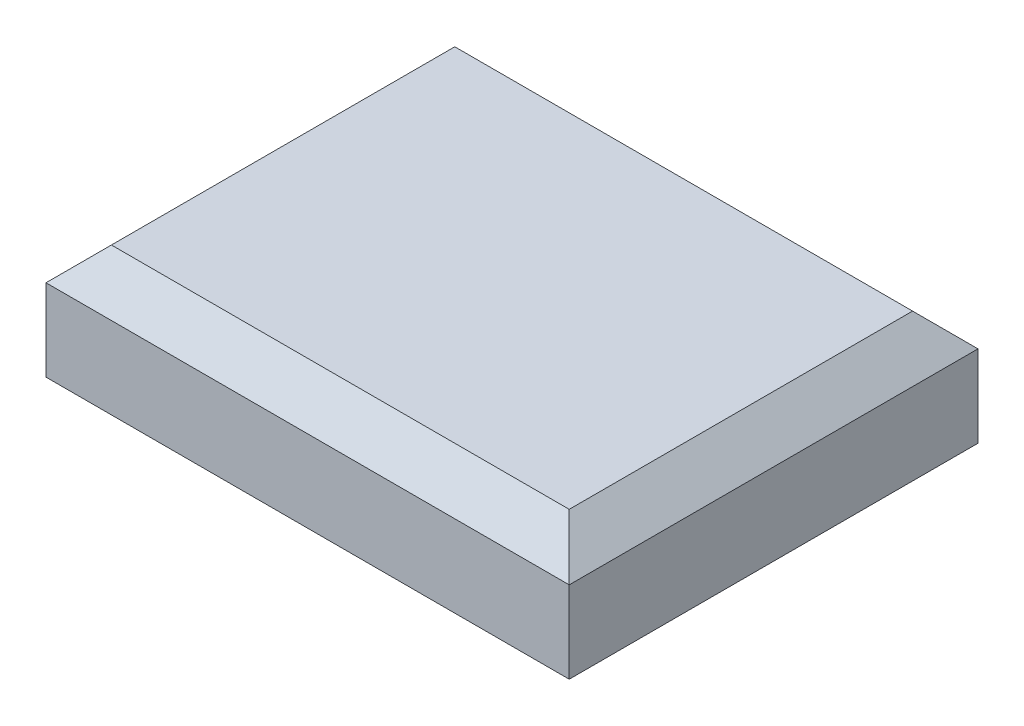
ISO-10303-21;
HEADER;
FILE_DESCRIPTION(('STEP AP214'),'2;1');
FILE_NAME('part.step','',(''),(''),'','','');
FILE_SCHEMA(('AUTOMOTIVE_DESIGN { 1 0 10303 214 1 1 1 1 }'));
ENDSEC;
DATA;
#1=APPLICATION_CONTEXT('core data for automotive mechanical design processes');
#2=APPLICATION_PROTOCOL_DEFINITION('international standard','automotive_design',2000,#1);
#3=PRODUCT_CONTEXT('',#1,'mechanical');
#4=PRODUCT('Part','Part','',(#3));
#5=PRODUCT_RELATED_PRODUCT_CATEGORY('part','',(#4));
#6=PRODUCT_DEFINITION_FORMATION('','',#4);
#7=PRODUCT_DEFINITION_CONTEXT('part definition',#1,'design');
#8=PRODUCT_DEFINITION('design','',#6,#7);
#9=PRODUCT_DEFINITION_SHAPE('','',#8);
#10=(LENGTH_UNIT() NAMED_UNIT(*) SI_UNIT(.MILLI.,.METRE.));
#11=(NAMED_UNIT(*) PLANE_ANGLE_UNIT() SI_UNIT($,.RADIAN.));
#12=(NAMED_UNIT(*) SI_UNIT($,.STERADIAN.) SOLID_ANGLE_UNIT());
#13=UNCERTAINTY_MEASURE_WITH_UNIT(LENGTH_MEASURE(1.E-05),#10,'distance_accuracy_value','');
#14=(GEOMETRIC_REPRESENTATION_CONTEXT(3) GLOBAL_UNCERTAINTY_ASSIGNED_CONTEXT((#13)) GLOBAL_UNIT_ASSIGNED_CONTEXT((#10,
#11,#12)) REPRESENTATION_CONTEXT('',''));
#15=CARTESIAN_POINT('',(0.,0.,0.));
#16=DIRECTION('',(0.,0.,1.));
#17=DIRECTION('',(1.,0.,0.));
#18=AXIS2_PLACEMENT_3D('',#15,#16,#17);
#19=CARTESIAN_POINT('',(1.6,0.7,1.25));
#20=DIRECTION('',(-1.,0.,0.));
#21=DIRECTION('',(0.,0.,1.));
#22=AXIS2_PLACEMENT_3D('',#19,#20,#21);
#23=PLANE('',#22);
#24=DIRECTION('',(0.,-1.,0.));
#25=VECTOR('',#24,1.);
#26=CARTESIAN_POINT('',(1.6,0.7,-1.25));
#27=LINE('',#26,#25);
#28=CARTESIAN_POINT('',(1.6,0.5,-1.25));
#29=VERTEX_POINT('',#28);
#30=CARTESIAN_POINT('',(1.6,0.,-1.25));
#31=VERTEX_POINT('',#30);
#32=EDGE_CURVE('E68',#29,#31,#27,.T.);
#33=ORIENTED_EDGE('',*,*,#32,.F.);
#34=DIRECTION('',(0.,0.,1.));
#35=VECTOR('',#34,1.);
#36=CARTESIAN_POINT('',(1.6,0.5,1.25));
#37=LINE('',#36,#35);
#38=CARTESIAN_POINT('',(1.6,0.5,1.25));
#39=VERTEX_POINT('',#38);
#40=EDGE_CURVE('E11',#29,#39,#37,.T.);
#41=ORIENTED_EDGE('',*,*,#40,.T.);
#42=DIRECTION('',(0.,-1.,0.));
#43=VECTOR('',#42,1.);
#44=CARTESIAN_POINT('',(1.6,0.7,1.25));
#45=LINE('',#44,#43);
#46=CARTESIAN_POINT('',(1.6,0.,1.25));
#47=VERTEX_POINT('',#46);
#48=EDGE_CURVE('E88',#39,#47,#45,.T.);
#49=ORIENTED_EDGE('',*,*,#48,.T.);
#50=DIRECTION('',(0.,0.,-1.));
#51=VECTOR('',#50,1.);
#52=CARTESIAN_POINT('',(1.6,0.,1.25));
#53=LINE('',#52,#51);
#54=EDGE_CURVE('E83',#47,#31,#53,.T.);
#55=ORIENTED_EDGE('',*,*,#54,.T.);
#56=EDGE_LOOP('',(#33,#41,#49,#55));
#57=FACE_BOUND('',#56,.T.);
#58=ADVANCED_FACE('F16',(#57),#23,.F.);
#59=CARTESIAN_POINT('',(-1.6,0.7,-1.25));
#60=DIRECTION('',(0.,0.,1.));
#61=DIRECTION('',(1.,0.,0.));
#62=AXIS2_PLACEMENT_3D('',#59,#60,#61);
#63=PLANE('',#62);
#64=DIRECTION('',(0.,-1.,0.));
#65=VECTOR('',#64,1.);
#66=CARTESIAN_POINT('',(-1.6,0.7,-1.25));
#67=LINE('',#66,#65);
#68=CARTESIAN_POINT('',(-1.6,0.5,-1.25));
#69=VERTEX_POINT('',#68);
#70=CARTESIAN_POINT('',(-1.6,0.,-1.25));
#71=VERTEX_POINT('',#70);
#72=EDGE_CURVE('E77',#69,#71,#67,.T.);
#73=ORIENTED_EDGE('',*,*,#72,.F.);
#74=DIRECTION('',(1.,0.,0.));
#75=VECTOR('',#74,1.);
#76=CARTESIAN_POINT('',(-1.6,0.5,-1.25));
#77=LINE('',#76,#75);
#78=EDGE_CURVE('E25',#69,#29,#77,.T.);
#79=ORIENTED_EDGE('',*,*,#78,.T.);
#80=ORIENTED_EDGE('',*,*,#32,.T.);
#81=DIRECTION('',(-1.,0.,0.));
#82=VECTOR('',#81,1.);
#83=CARTESIAN_POINT('',(-1.6,0.,-1.25));
#84=LINE('',#83,#82);
#85=EDGE_CURVE('E71',#31,#71,#84,.T.);
#86=ORIENTED_EDGE('',*,*,#85,.T.);
#87=EDGE_LOOP('',(#73,#79,#80,#86));
#88=FACE_BOUND('',#87,.T.);
#89=ADVANCED_FACE('F70',(#88),#63,.F.);
#90=CARTESIAN_POINT('',(-1.6,0.7,1.25));
#91=DIRECTION('',(1.,0.,0.));
#92=DIRECTION('',(0.,0.,-1.));
#93=AXIS2_PLACEMENT_3D('',#90,#91,#92);
#94=PLANE('',#93);
#95=DIRECTION('',(0.,-1.,0.));
#96=VECTOR('',#95,1.);
#97=CARTESIAN_POINT('',(-1.6,0.7,1.25));
#98=LINE('',#97,#96);
#99=CARTESIAN_POINT('',(-1.6,0.5,1.25));
#100=VERTEX_POINT('',#99);
#101=CARTESIAN_POINT('',(-1.6,0.,1.25));
#102=VERTEX_POINT('',#101);
#103=EDGE_CURVE('E98',#100,#102,#98,.T.);
#104=ORIENTED_EDGE('',*,*,#103,.F.);
#105=DIRECTION('',(0.,0.,-1.));
#106=VECTOR('',#105,1.);
#107=CARTESIAN_POINT('',(-1.6,0.5,1.25));
#108=LINE('',#107,#106);
#109=EDGE_CURVE('E40',#100,#69,#108,.T.);
#110=ORIENTED_EDGE('',*,*,#109,.T.);
#111=ORIENTED_EDGE('',*,*,#72,.T.);
#112=DIRECTION('',(0.,0.,1.));
#113=VECTOR('',#112,1.);
#114=CARTESIAN_POINT('',(-1.6,0.,1.25));
#115=LINE('',#114,#113);
#116=EDGE_CURVE('E85',#71,#102,#115,.T.);
#117=ORIENTED_EDGE('',*,*,#116,.T.);
#118=EDGE_LOOP('',(#104,#110,#111,#117));
#119=FACE_BOUND('',#118,.T.);
#120=ADVANCED_FACE('F136',(#119),#94,.F.);
#121=CARTESIAN_POINT('',(-1.6,0.7,1.25));
#122=DIRECTION('',(0.,0.,-1.));
#123=DIRECTION('',(-1.,0.,0.));
#124=AXIS2_PLACEMENT_3D('',#121,#122,#123);
#125=PLANE('',#124);
#126=ORIENTED_EDGE('',*,*,#48,.F.);
#127=DIRECTION('',(-1.,0.,0.));
#128=VECTOR('',#127,1.);
#129=CARTESIAN_POINT('',(-1.6,0.5,1.25));
#130=LINE('',#129,#128);
#131=EDGE_CURVE('E109',#39,#100,#130,.T.);
#132=ORIENTED_EDGE('',*,*,#131,.T.);
#133=ORIENTED_EDGE('',*,*,#103,.T.);
#134=DIRECTION('',(1.,0.,0.));
#135=VECTOR('',#134,1.);
#136=CARTESIAN_POINT('',(-1.6,0.,1.25));
#137=LINE('',#136,#135);
#138=EDGE_CURVE('E95',#102,#47,#137,.T.);
#139=ORIENTED_EDGE('',*,*,#138,.T.);
#140=EDGE_LOOP('',(#126,#132,#133,#139));
#141=FACE_BOUND('',#140,.T.);
#142=ADVANCED_FACE('F135',(#141),#125,.F.);
#143=CARTESIAN_POINT('',(0.,0.7,0.));
#144=DIRECTION('',(0.,-1.,0.));
#145=DIRECTION('',(0.,0.,-1.));
#146=AXIS2_PLACEMENT_3D('',#143,#144,#145);
#147=PLANE('',#146);
#148=DIRECTION('',(0.,0.,1.));
#149=VECTOR('',#148,1.);
#150=CARTESIAN_POINT('',(-1.4,0.7,0.));
#151=LINE('',#150,#149);
#152=CARTESIAN_POINT('',(-1.4,0.7,-1.05));
#153=VERTEX_POINT('',#152);
#154=CARTESIAN_POINT('',(-1.4,0.7,1.05));
#155=VERTEX_POINT('',#154);
#156=EDGE_CURVE('E104',#153,#155,#151,.T.);
#157=ORIENTED_EDGE('',*,*,#156,.T.);
#158=DIRECTION('',(1.,0.,0.));
#159=VECTOR('',#158,1.);
#160=CARTESIAN_POINT('',(0.,0.7,1.05));
#161=LINE('',#160,#159);
#162=CARTESIAN_POINT('',(1.4,0.7,1.05));
#163=VERTEX_POINT('',#162);
#164=EDGE_CURVE('E106',#155,#163,#161,.T.);
#165=ORIENTED_EDGE('',*,*,#164,.T.);
#166=DIRECTION('',(0.,0.,-1.));
#167=VECTOR('',#166,1.);
#168=CARTESIAN_POINT('',(1.4,0.7,0.));
#169=LINE('',#168,#167);
#170=CARTESIAN_POINT('',(1.4,0.7,-1.05));
#171=VERTEX_POINT('',#170);
#172=EDGE_CURVE('E76',#163,#171,#169,.T.);
#173=ORIENTED_EDGE('',*,*,#172,.T.);
#174=DIRECTION('',(-1.,0.,0.));
#175=VECTOR('',#174,1.);
#176=CARTESIAN_POINT('',(0.,0.7,-1.05));
#177=LINE('',#176,#175);
#178=EDGE_CURVE('E102',#171,#153,#177,.T.);
#179=ORIENTED_EDGE('',*,*,#178,.T.);
#180=EDGE_LOOP('',(#157,#165,#173,#179));
#181=FACE_BOUND('',#180,.T.);
#182=ADVANCED_FACE('F128',(#181),#147,.F.);
#183=CARTESIAN_POINT('',(0.,0.,0.));
#184=DIRECTION('',(0.,-1.,0.));
#185=DIRECTION('',(0.,0.,-1.));
#186=AXIS2_PLACEMENT_3D('',#183,#184,#185);
#187=PLANE('',#186);
#188=ORIENTED_EDGE('',*,*,#54,.F.);
#189=ORIENTED_EDGE('',*,*,#138,.F.);
#190=ORIENTED_EDGE('',*,*,#116,.F.);
#191=ORIENTED_EDGE('',*,*,#85,.F.);
#192=EDGE_LOOP('',(#188,#189,#190,#191));
#193=FACE_BOUND('',#192,.T.);
#194=ADVANCED_FACE('F81',(#193),#187,.T.);
#195=CARTESIAN_POINT('',(0.,0.7,-1.05));
#196=DIRECTION('',(0.,-0.707106781186546,0.707106781186549));
#197=DIRECTION('',(-1.,0.,0.));
#198=AXIS2_PLACEMENT_3D('',#195,#196,#197);
#199=PLANE('',#198);
#200=DIRECTION('',(-0.577350269189625,0.577350269189628,0.577350269189625));
#201=VECTOR('',#200,1.);
#202=CARTESIAN_POINT('',(1.05,1.05,-0.7));
#203=LINE('',#202,#201);
#204=EDGE_CURVE('E92',#29,#171,#203,.T.);
#205=ORIENTED_EDGE('',*,*,#204,.F.);
#206=ORIENTED_EDGE('',*,*,#78,.F.);
#207=DIRECTION('',(0.577350269189625,0.577350269189628,0.577350269189625));
#208=VECTOR('',#207,1.);
#209=CARTESIAN_POINT('',(-0.933333333333335,1.16666666666667,-0.583333333333335));
#210=LINE('',#209,#208);
#211=EDGE_CURVE('E20',#153,#69,#210,.F.);
#212=ORIENTED_EDGE('',*,*,#211,.F.);
#213=ORIENTED_EDGE('',*,*,#178,.F.);
#214=EDGE_LOOP('',(#205,#206,#212,#213));
#215=FACE_BOUND('',#214,.T.);
#216=ADVANCED_FACE('F18',(#215),#199,.F.);
#217=CARTESIAN_POINT('',(-1.4,0.7,0.));
#218=DIRECTION('',(0.707106781186549,-0.707106781186546,0.));
#219=DIRECTION('',(0.,0.,1.));
#220=AXIS2_PLACEMENT_3D('',#217,#218,#219);
#221=PLANE('',#220);
#222=ORIENTED_EDGE('',*,*,#211,.T.);
#223=ORIENTED_EDGE('',*,*,#109,.F.);
#224=DIRECTION('',(0.577350269189625,0.577350269189628,-0.577350269189625));
#225=VECTOR('',#224,1.);
#226=CARTESIAN_POINT('',(-1.05,1.05,0.7));
#227=LINE('',#226,#225);
#228=EDGE_CURVE('E116',#155,#100,#227,.F.);
#229=ORIENTED_EDGE('',*,*,#228,.F.);
#230=ORIENTED_EDGE('',*,*,#156,.F.);
#231=EDGE_LOOP('',(#222,#223,#229,#230));
#232=FACE_BOUND('',#231,.T.);
#233=ADVANCED_FACE('F154',(#232),#221,.F.);
#234=CARTESIAN_POINT('',(1.4,0.7,0.));
#235=DIRECTION('',(-0.707106781186549,-0.707106781186546,0.));
#236=DIRECTION('',(0.,0.,-1.));
#237=AXIS2_PLACEMENT_3D('',#234,#235,#236);
#238=PLANE('',#237);
#239=ORIENTED_EDGE('',*,*,#204,.T.);
#240=ORIENTED_EDGE('',*,*,#172,.F.);
#241=DIRECTION('',(0.577350269189625,-0.577350269189628,0.577350269189625));
#242=VECTOR('',#241,1.);
#243=CARTESIAN_POINT('',(1.05,1.05,0.7));
#244=LINE('',#243,#242);
#245=EDGE_CURVE('E114',#39,#163,#244,.F.);
#246=ORIENTED_EDGE('',*,*,#245,.F.);
#247=ORIENTED_EDGE('',*,*,#40,.F.);
#248=EDGE_LOOP('',(#239,#240,#246,#247));
#249=FACE_BOUND('',#248,.T.);
#250=ADVANCED_FACE('F121',(#249),#238,.F.);
#251=CARTESIAN_POINT('',(0.,0.7,1.05));
#252=DIRECTION('',(0.,-0.707106781186546,-0.707106781186549));
#253=DIRECTION('',(1.,0.,0.));
#254=AXIS2_PLACEMENT_3D('',#251,#252,#253);
#255=PLANE('',#254);
#256=ORIENTED_EDGE('',*,*,#228,.T.);
#257=ORIENTED_EDGE('',*,*,#131,.F.);
#258=ORIENTED_EDGE('',*,*,#245,.T.);
#259=ORIENTED_EDGE('',*,*,#164,.F.);
#260=EDGE_LOOP('',(#256,#257,#258,#259));
#261=FACE_BOUND('',#260,.T.);
#262=ADVANCED_FACE('F132',(#261),#255,.F.);
#263=CLOSED_SHELL('',(#58,#89,#120,#142,#182,#194,#216,#233,#250,#262));
#264=MANIFOLD_SOLID_BREP('B1',#263);
#265=ADVANCED_BREP_SHAPE_REPRESENTATION('',(#18,#264),#14);
#266=SHAPE_DEFINITION_REPRESENTATION(#9,#265);
ENDSEC;
END-ISO-10303-21;
